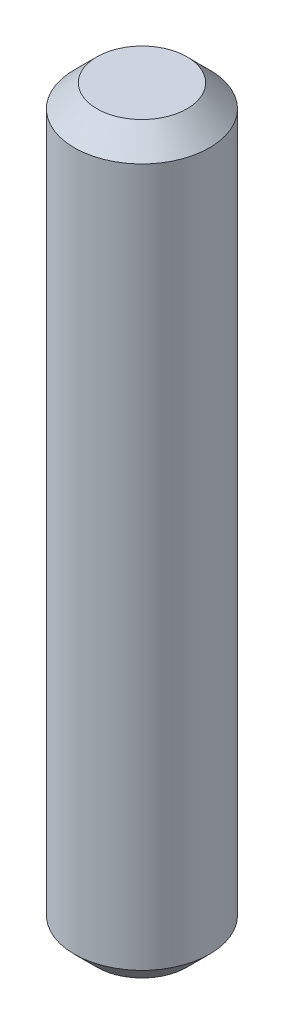
ISO-10303-21;
HEADER;
FILE_DESCRIPTION(('STEP AP214'),'2;1');
FILE_NAME('part.step','',(''),(''),'','','');
FILE_SCHEMA(('AUTOMOTIVE_DESIGN { 1 0 10303 214 1 1 1 1 }'));
ENDSEC;
DATA;
#1=APPLICATION_CONTEXT('core data for automotive mechanical design processes');
#2=APPLICATION_PROTOCOL_DEFINITION('international standard','automotive_design',2000,#1);
#3=PRODUCT_CONTEXT('',#1,'mechanical');
#4=PRODUCT('Part','Part','',(#3));
#5=PRODUCT_RELATED_PRODUCT_CATEGORY('part','',(#4));
#6=PRODUCT_DEFINITION_FORMATION('','',#4);
#7=PRODUCT_DEFINITION_CONTEXT('part definition',#1,'design');
#8=PRODUCT_DEFINITION('design','',#6,#7);
#9=PRODUCT_DEFINITION_SHAPE('','',#8);
#10=(LENGTH_UNIT() NAMED_UNIT(*) SI_UNIT(.MILLI.,.METRE.));
#11=(NAMED_UNIT(*) PLANE_ANGLE_UNIT() SI_UNIT($,.RADIAN.));
#12=(NAMED_UNIT(*) SI_UNIT($,.STERADIAN.) SOLID_ANGLE_UNIT());
#13=UNCERTAINTY_MEASURE_WITH_UNIT(LENGTH_MEASURE(1.E-05),#10,'distance_accuracy_value','');
#14=(GEOMETRIC_REPRESENTATION_CONTEXT(3) GLOBAL_UNCERTAINTY_ASSIGNED_CONTEXT((#13)) GLOBAL_UNIT_ASSIGNED_CONTEXT((#10,
#11,#12)) REPRESENTATION_CONTEXT('',''));
#15=CARTESIAN_POINT('',(0.,0.,0.));
#16=DIRECTION('',(0.,0.,1.));
#17=DIRECTION('',(1.,0.,0.));
#18=AXIS2_PLACEMENT_3D('',#15,#16,#17);
#19=CARTESIAN_POINT('',(0.,33.,0.));
#20=DIRECTION('',(0.,-1.,0.));
#21=DIRECTION('',(0.,0.,-1.));
#22=AXIS2_PLACEMENT_3D('',#19,#20,#21);
#23=CYLINDRICAL_SURFACE('',#22,3.);
#24=CARTESIAN_POINT('',(0.,0.999999999999994,0.));
#25=DIRECTION('',(0.,1.,0.));
#26=DIRECTION('',(0.,0.,1.));
#27=AXIS2_PLACEMENT_3D('',#24,#25,#26);
#28=CIRCLE('',#27,3.);
#29=CARTESIAN_POINT('',(0.,0.999999999999994,3.));
#30=VERTEX_POINT('',#29);
#31=EDGE_CURVE('E42',#30,#30,#28,.T.);
#32=ORIENTED_EDGE('',*,*,#31,.T.);
#33=EDGE_LOOP('',(#32));
#34=FACE_BOUND('',#33,.T.);
#35=CARTESIAN_POINT('',(0.,32.,0.));
#36=DIRECTION('',(0.,1.,0.));
#37=DIRECTION('',(0.,0.,1.));
#38=AXIS2_PLACEMENT_3D('',#35,#36,#37);
#39=CIRCLE('',#38,3.);
#40=CARTESIAN_POINT('',(0.,32.,3.));
#41=VERTEX_POINT('',#40);
#42=EDGE_CURVE('E46',#41,#41,#39,.F.);
#43=ORIENTED_EDGE('',*,*,#42,.T.);
#44=EDGE_LOOP('',(#43));
#45=FACE_BOUND('',#44,.T.);
#46=ADVANCED_FACE('F31',(#34,#45),#23,.T.);
#47=CARTESIAN_POINT('',(0.,33.,0.));
#48=DIRECTION('',(0.,1.,0.));
#49=DIRECTION('',(0.,0.,1.));
#50=AXIS2_PLACEMENT_3D('',#47,#48,#49);
#51=PLANE('',#50);
#52=CARTESIAN_POINT('',(0.,33.,0.));
#53=DIRECTION('',(0.,1.,0.));
#54=DIRECTION('',(0.,0.,1.));
#55=AXIS2_PLACEMENT_3D('',#52,#53,#54);
#56=CIRCLE('',#55,1.99999999999999);
#57=CARTESIAN_POINT('',(0.,33.,1.99999999999999));
#58=VERTEX_POINT('',#57);
#59=EDGE_CURVE('E10',#58,#58,#56,.T.);
#60=ORIENTED_EDGE('',*,*,#59,.T.);
#61=EDGE_LOOP('',(#60));
#62=FACE_BOUND('',#61,.T.);
#63=ADVANCED_FACE('F62',(#62),#51,.T.);
#64=CARTESIAN_POINT('',(0.,0.,0.));
#65=DIRECTION('',(0.,1.,0.));
#66=DIRECTION('',(0.,0.,1.));
#67=AXIS2_PLACEMENT_3D('',#64,#65,#66);
#68=PLANE('',#67);
#69=CARTESIAN_POINT('',(0.,0.,0.));
#70=DIRECTION('',(0.,1.,0.));
#71=DIRECTION('',(0.,0.,1.));
#72=AXIS2_PLACEMENT_3D('',#69,#70,#71);
#73=CIRCLE('',#72,2.);
#74=CARTESIAN_POINT('',(0.,0.,2.));
#75=VERTEX_POINT('',#74);
#76=EDGE_CURVE('E38',#75,#75,#73,.F.);
#77=ORIENTED_EDGE('',*,*,#76,.T.);
#78=EDGE_LOOP('',(#77));
#79=FACE_BOUND('',#78,.T.);
#80=ADVANCED_FACE('F59',(#79),#68,.F.);
#81=CARTESIAN_POINT('',(0.,0.999999999999994,0.));
#82=DIRECTION('',(0.,1.,0.));
#83=DIRECTION('',(0.,0.,1.));
#84=AXIS2_PLACEMENT_3D('',#81,#82,#83);
#85=CONICAL_SURFACE('',#84,3.,0.78539816339745);
#86=ORIENTED_EDGE('',*,*,#76,.F.);
#87=EDGE_LOOP('',(#86));
#88=FACE_BOUND('',#87,.T.);
#89=ORIENTED_EDGE('',*,*,#31,.F.);
#90=EDGE_LOOP('',(#89));
#91=FACE_BOUND('',#90,.T.);
#92=ADVANCED_FACE('F55',(#88,#91),#85,.T.);
#93=CARTESIAN_POINT('',(0.,33.,0.));
#94=DIRECTION('',(0.,-1.,0.));
#95=DIRECTION('',(0.,0.,-1.));
#96=AXIS2_PLACEMENT_3D('',#93,#94,#95);
#97=CONICAL_SURFACE('',#96,1.99999999999999,0.785398163397449);
#98=ORIENTED_EDGE('',*,*,#42,.F.);
#99=EDGE_LOOP('',(#98));
#100=FACE_BOUND('',#99,.T.);
#101=ORIENTED_EDGE('',*,*,#59,.F.);
#102=EDGE_LOOP('',(#101));
#103=FACE_BOUND('',#102,.T.);
#104=ADVANCED_FACE('F33',(#100,#103),#97,.T.);
#105=CLOSED_SHELL('',(#46,#63,#80,#92,#104));
#106=MANIFOLD_SOLID_BREP('B2',#105);
#107=ADVANCED_BREP_SHAPE_REPRESENTATION('',(#18,#106),#14);
#108=SHAPE_DEFINITION_REPRESENTATION(#9,#107);
ENDSEC;
END-ISO-10303-21;
